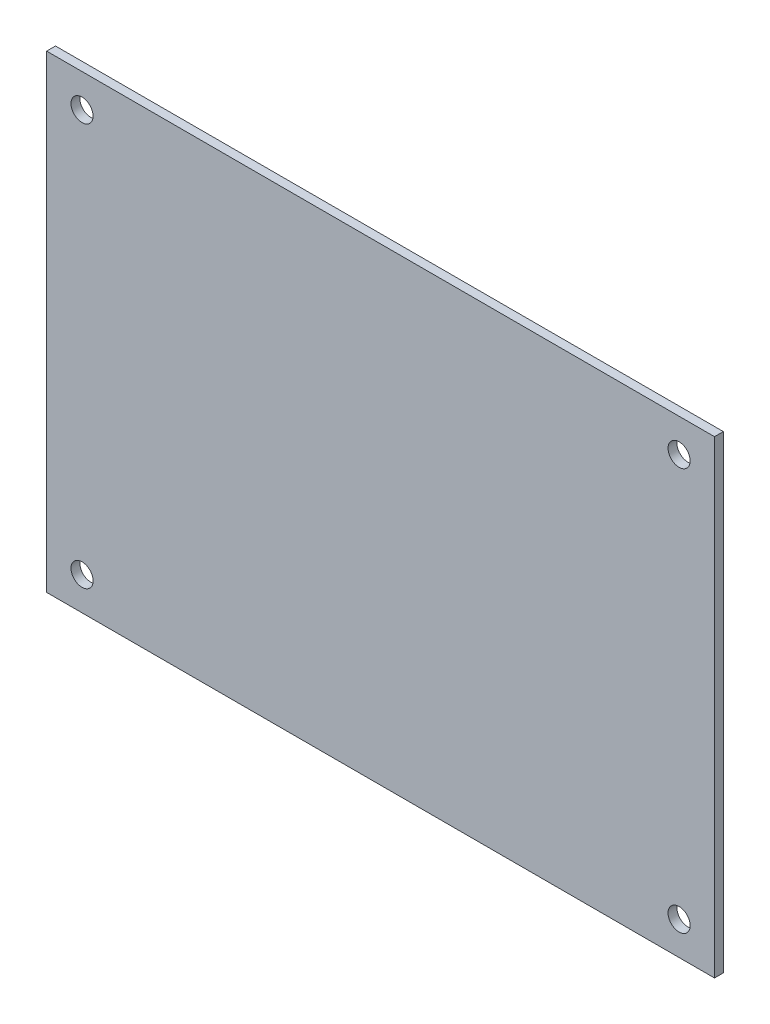
ISO-10303-21;
HEADER;
FILE_DESCRIPTION(('STEP AP214'),'2;1');
FILE_NAME('part.step','',(''),(''),'','','');
FILE_SCHEMA(('AUTOMOTIVE_DESIGN { 1 0 10303 214 1 1 1 1 }'));
ENDSEC;
DATA;
#1=APPLICATION_CONTEXT('core data for automotive mechanical design processes');
#2=APPLICATION_PROTOCOL_DEFINITION('international standard','automotive_design',2000,#1);
#3=PRODUCT_CONTEXT('',#1,'mechanical');
#4=PRODUCT('Part','Part','',(#3));
#5=PRODUCT_RELATED_PRODUCT_CATEGORY('part','',(#4));
#6=PRODUCT_DEFINITION_FORMATION('','',#4);
#7=PRODUCT_DEFINITION_CONTEXT('part definition',#1,'design');
#8=PRODUCT_DEFINITION('design','',#6,#7);
#9=PRODUCT_DEFINITION_SHAPE('','',#8);
#10=(LENGTH_UNIT() NAMED_UNIT(*) SI_UNIT(.MILLI.,.METRE.));
#11=(NAMED_UNIT(*) PLANE_ANGLE_UNIT() SI_UNIT($,.RADIAN.));
#12=(NAMED_UNIT(*) SI_UNIT($,.STERADIAN.) SOLID_ANGLE_UNIT());
#13=UNCERTAINTY_MEASURE_WITH_UNIT(LENGTH_MEASURE(1.E-05),#10,'distance_accuracy_value','');
#14=(GEOMETRIC_REPRESENTATION_CONTEXT(3) GLOBAL_UNCERTAINTY_ASSIGNED_CONTEXT((#13)) GLOBAL_UNIT_ASSIGNED_CONTEXT((#10,
#11,#12)) REPRESENTATION_CONTEXT('',''));
#15=CARTESIAN_POINT('',(0.,0.,0.));
#16=DIRECTION('',(0.,0.,1.));
#17=DIRECTION('',(1.,0.,0.));
#18=AXIS2_PLACEMENT_3D('',#15,#16,#17);
#19=CARTESIAN_POINT('',(0.,0.,0.));
#20=DIRECTION('',(0.,0.,1.));
#21=DIRECTION('',(1.,0.,0.));
#22=AXIS2_PLACEMENT_3D('',#19,#20,#21);
#23=PLANE('',#22);
#24=DIRECTION('',(0.,-1.,0.));
#25=VECTOR('',#24,1.);
#26=CARTESIAN_POINT('',(2.,0.,0.));
#27=LINE('',#26,#25);
#28=CARTESIAN_POINT('',(2.,108.,0.));
#29=VERTEX_POINT('',#28);
#30=CARTESIAN_POINT('',(2.,2.,0.));
#31=VERTEX_POINT('',#30);
#32=EDGE_CURVE('E89',#29,#31,#27,.T.);
#33=ORIENTED_EDGE('',*,*,#32,.F.);
#34=DIRECTION('',(1.,0.,0.));
#35=VECTOR('',#34,1.);
#36=CARTESIAN_POINT('',(0.,108.,0.));
#37=LINE('',#36,#35);
#38=CARTESIAN_POINT('',(153.,108.,0.));
#39=VERTEX_POINT('',#38);
#40=EDGE_CURVE('E83',#29,#39,#37,.T.);
#41=ORIENTED_EDGE('',*,*,#40,.T.);
#42=DIRECTION('',(0.,-1.,0.));
#43=VECTOR('',#42,1.);
#44=CARTESIAN_POINT('',(153.,0.,0.));
#45=LINE('',#44,#43);
#46=CARTESIAN_POINT('',(153.,2.,0.));
#47=VERTEX_POINT('',#46);
#48=EDGE_CURVE('E92',#39,#47,#45,.T.);
#49=ORIENTED_EDGE('',*,*,#48,.T.);
#50=DIRECTION('',(-1.,0.,0.));
#51=VECTOR('',#50,1.);
#52=CARTESIAN_POINT('',(0.,2.,0.));
#53=LINE('',#52,#51);
#54=EDGE_CURVE('E53',#47,#31,#53,.T.);
#55=ORIENTED_EDGE('',*,*,#54,.T.);
#56=EDGE_LOOP('',(#33,#41,#49,#55));
#57=FACE_BOUND('',#56,.T.);
#58=CARTESIAN_POINT('',(145.,100.5,0.));
#59=DIRECTION('',(0.,0.,1.));
#60=DIRECTION('',(1.,0.,0.));
#61=AXIS2_PLACEMENT_3D('',#58,#59,#60);
#62=CIRCLE('',#61,2.5);
#63=CARTESIAN_POINT('',(147.5,100.5,0.));
#64=VERTEX_POINT('',#63);
#65=EDGE_CURVE('E128',#64,#64,#62,.T.);
#66=ORIENTED_EDGE('',*,*,#65,.T.);
#67=EDGE_LOOP('',(#66));
#68=FACE_BOUND('',#67,.T.);
#69=CARTESIAN_POINT('',(10.,9.5,0.));
#70=DIRECTION('',(0.,0.,1.));
#71=DIRECTION('',(1.,0.,0.));
#72=AXIS2_PLACEMENT_3D('',#69,#70,#71);
#73=CIRCLE('',#72,2.5);
#74=CARTESIAN_POINT('',(12.5,9.5,0.));
#75=VERTEX_POINT('',#74);
#76=EDGE_CURVE('E119',#75,#75,#73,.T.);
#77=ORIENTED_EDGE('',*,*,#76,.T.);
#78=EDGE_LOOP('',(#77));
#79=FACE_BOUND('',#78,.T.);
#80=CARTESIAN_POINT('',(145.,9.5,0.));
#81=DIRECTION('',(0.,0.,1.));
#82=DIRECTION('',(1.,0.,0.));
#83=AXIS2_PLACEMENT_3D('',#80,#81,#82);
#84=CIRCLE('',#83,2.5);
#85=CARTESIAN_POINT('',(147.5,9.5,0.));
#86=VERTEX_POINT('',#85);
#87=EDGE_CURVE('E108',#86,#86,#84,.T.);
#88=ORIENTED_EDGE('',*,*,#87,.T.);
#89=EDGE_LOOP('',(#88));
#90=FACE_BOUND('',#89,.T.);
#91=CARTESIAN_POINT('',(10.,100.5,0.));
#92=DIRECTION('',(0.,0.,1.));
#93=DIRECTION('',(1.,0.,0.));
#94=AXIS2_PLACEMENT_3D('',#91,#92,#93);
#95=CIRCLE('',#94,2.5);
#96=CARTESIAN_POINT('',(12.5,100.5,0.));
#97=VERTEX_POINT('',#96);
#98=EDGE_CURVE('E139',#97,#97,#95,.T.);
#99=ORIENTED_EDGE('',*,*,#98,.T.);
#100=EDGE_LOOP('',(#99));
#101=FACE_BOUND('',#100,.T.);
#102=ADVANCED_FACE('F38',(#57,#68,#79,#90,#101),#23,.F.);
#103=CARTESIAN_POINT('',(0.,0.,2.));
#104=DIRECTION('',(0.,0.,-1.));
#105=DIRECTION('',(-1.,0.,0.));
#106=AXIS2_PLACEMENT_3D('',#103,#104,#105);
#107=PLANE('',#106);
#108=CARTESIAN_POINT('',(145.,100.5,2.));
#109=DIRECTION('',(0.,0.,1.));
#110=DIRECTION('',(1.,0.,0.));
#111=AXIS2_PLACEMENT_3D('',#108,#109,#110);
#112=CIRCLE('',#111,2.5);
#113=CARTESIAN_POINT('',(147.5,100.5,2.));
#114=VERTEX_POINT('',#113);
#115=EDGE_CURVE('E123',#114,#114,#112,.T.);
#116=ORIENTED_EDGE('',*,*,#115,.F.);
#117=EDGE_LOOP('',(#116));
#118=FACE_BOUND('',#117,.T.);
#119=CARTESIAN_POINT('',(10.,9.5,2.));
#120=DIRECTION('',(0.,0.,1.));
#121=DIRECTION('',(1.,0.,0.));
#122=AXIS2_PLACEMENT_3D('',#119,#120,#121);
#123=CIRCLE('',#122,2.5);
#124=CARTESIAN_POINT('',(12.5,9.5,2.));
#125=VERTEX_POINT('',#124);
#126=EDGE_CURVE('E132',#125,#125,#123,.T.);
#127=ORIENTED_EDGE('',*,*,#126,.F.);
#128=EDGE_LOOP('',(#127));
#129=FACE_BOUND('',#128,.T.);
#130=CARTESIAN_POINT('',(145.,9.5,2.));
#131=DIRECTION('',(0.,0.,1.));
#132=DIRECTION('',(1.,0.,0.));
#133=AXIS2_PLACEMENT_3D('',#130,#131,#132);
#134=CIRCLE('',#133,2.5);
#135=CARTESIAN_POINT('',(147.5,9.5,2.));
#136=VERTEX_POINT('',#135);
#137=EDGE_CURVE('E115',#136,#136,#134,.T.);
#138=ORIENTED_EDGE('',*,*,#137,.F.);
#139=EDGE_LOOP('',(#138));
#140=FACE_BOUND('',#139,.T.);
#141=CARTESIAN_POINT('',(10.,100.5,2.));
#142=DIRECTION('',(0.,0.,1.));
#143=DIRECTION('',(1.,0.,0.));
#144=AXIS2_PLACEMENT_3D('',#141,#142,#143);
#145=CIRCLE('',#144,2.5);
#146=CARTESIAN_POINT('',(12.5,100.5,2.));
#147=VERTEX_POINT('',#146);
#148=EDGE_CURVE('E127',#147,#147,#145,.T.);
#149=ORIENTED_EDGE('',*,*,#148,.F.);
#150=EDGE_LOOP('',(#149));
#151=FACE_BOUND('',#150,.T.);
#152=DIRECTION('',(-1.,0.,0.));
#153=VECTOR('',#152,1.);
#154=CARTESIAN_POINT('',(153.,2.,2.));
#155=LINE('',#154,#153);
#156=CARTESIAN_POINT('',(153.,2.,2.));
#157=VERTEX_POINT('',#156);
#158=CARTESIAN_POINT('',(2.,2.,2.));
#159=VERTEX_POINT('',#158);
#160=EDGE_CURVE('E46',#157,#159,#155,.T.);
#161=ORIENTED_EDGE('',*,*,#160,.F.);
#162=DIRECTION('',(0.,1.,0.));
#163=VECTOR('',#162,1.);
#164=CARTESIAN_POINT('',(153.,2.,2.));
#165=LINE('',#164,#163);
#166=CARTESIAN_POINT('',(153.,108.,2.));
#167=VERTEX_POINT('',#166);
#168=EDGE_CURVE('E11',#157,#167,#165,.T.);
#169=ORIENTED_EDGE('',*,*,#168,.T.);
#170=DIRECTION('',(-1.,0.,0.));
#171=VECTOR('',#170,1.);
#172=CARTESIAN_POINT('',(153.,108.,2.));
#173=LINE('',#172,#171);
#174=CARTESIAN_POINT('',(2.,108.,2.));
#175=VERTEX_POINT('',#174);
#176=EDGE_CURVE('E86',#167,#175,#173,.T.);
#177=ORIENTED_EDGE('',*,*,#176,.T.);
#178=DIRECTION('',(0.,1.,0.));
#179=VECTOR('',#178,1.);
#180=CARTESIAN_POINT('',(2.,2.,2.));
#181=LINE('',#180,#179);
#182=EDGE_CURVE('E148',#159,#175,#181,.T.);
#183=ORIENTED_EDGE('',*,*,#182,.F.);
#184=EDGE_LOOP('',(#161,#169,#177,#183));
#185=FACE_BOUND('',#184,.T.);
#186=ADVANCED_FACE('F157',(#118,#129,#140,#151,#185),#107,.F.);
#187=CARTESIAN_POINT('',(10.,100.5,0.));
#188=DIRECTION('',(0.,0.,1.));
#189=DIRECTION('',(1.,0.,0.));
#190=AXIS2_PLACEMENT_3D('',#187,#188,#189);
#191=CYLINDRICAL_SURFACE('',#190,2.5);
#192=ORIENTED_EDGE('',*,*,#98,.F.);
#193=EDGE_LOOP('',(#192));
#194=FACE_BOUND('',#193,.T.);
#195=ORIENTED_EDGE('',*,*,#148,.T.);
#196=EDGE_LOOP('',(#195));
#197=FACE_BOUND('',#196,.T.);
#198=ADVANCED_FACE('F159',(#194,#197),#191,.F.);
#199=CARTESIAN_POINT('',(145.,9.5,0.));
#200=DIRECTION('',(0.,0.,1.));
#201=DIRECTION('',(1.,0.,0.));
#202=AXIS2_PLACEMENT_3D('',#199,#200,#201);
#203=CYLINDRICAL_SURFACE('',#202,2.5);
#204=ORIENTED_EDGE('',*,*,#87,.F.);
#205=EDGE_LOOP('',(#204));
#206=FACE_BOUND('',#205,.T.);
#207=ORIENTED_EDGE('',*,*,#137,.T.);
#208=EDGE_LOOP('',(#207));
#209=FACE_BOUND('',#208,.T.);
#210=ADVANCED_FACE('F166',(#206,#209),#203,.F.);
#211=CARTESIAN_POINT('',(10.,9.5,0.));
#212=DIRECTION('',(0.,0.,1.));
#213=DIRECTION('',(1.,0.,0.));
#214=AXIS2_PLACEMENT_3D('',#211,#212,#213);
#215=CYLINDRICAL_SURFACE('',#214,2.5);
#216=ORIENTED_EDGE('',*,*,#76,.F.);
#217=EDGE_LOOP('',(#216));
#218=FACE_BOUND('',#217,.T.);
#219=ORIENTED_EDGE('',*,*,#126,.T.);
#220=EDGE_LOOP('',(#219));
#221=FACE_BOUND('',#220,.T.);
#222=ADVANCED_FACE('F172',(#218,#221),#215,.F.);
#223=CARTESIAN_POINT('',(145.,100.5,0.));
#224=DIRECTION('',(0.,0.,1.));
#225=DIRECTION('',(1.,0.,0.));
#226=AXIS2_PLACEMENT_3D('',#223,#224,#225);
#227=CYLINDRICAL_SURFACE('',#226,2.5);
#228=ORIENTED_EDGE('',*,*,#65,.F.);
#229=EDGE_LOOP('',(#228));
#230=FACE_BOUND('',#229,.T.);
#231=ORIENTED_EDGE('',*,*,#115,.T.);
#232=EDGE_LOOP('',(#231));
#233=FACE_BOUND('',#232,.T.);
#234=ADVANCED_FACE('F175',(#230,#233),#227,.F.);
#235=CARTESIAN_POINT('',(0.,2.,0.));
#236=DIRECTION('',(0.,1.,0.));
#237=DIRECTION('',(0.,0.,1.));
#238=AXIS2_PLACEMENT_3D('',#235,#236,#237);
#239=PLANE('',#238);
#240=DIRECTION('',(0.,0.,1.));
#241=VECTOR('',#240,1.);
#242=CARTESIAN_POINT('',(2.,2.,0.));
#243=LINE('',#242,#241);
#244=EDGE_CURVE('E109',#31,#159,#243,.T.);
#245=ORIENTED_EDGE('',*,*,#244,.F.);
#246=ORIENTED_EDGE('',*,*,#54,.F.);
#247=DIRECTION('',(0.,0.,1.));
#248=VECTOR('',#247,1.);
#249=CARTESIAN_POINT('',(153.,2.,0.));
#250=LINE('',#249,#248);
#251=EDGE_CURVE('E88',#47,#157,#250,.T.);
#252=ORIENTED_EDGE('',*,*,#251,.T.);
#253=ORIENTED_EDGE('',*,*,#160,.T.);
#254=EDGE_LOOP('',(#245,#246,#252,#253));
#255=FACE_BOUND('',#254,.T.);
#256=ADVANCED_FACE('F152',(#255),#239,.F.);
#257=CARTESIAN_POINT('',(153.,0.,0.));
#258=DIRECTION('',(-1.,0.,0.));
#259=DIRECTION('',(0.,0.,1.));
#260=AXIS2_PLACEMENT_3D('',#257,#258,#259);
#261=PLANE('',#260);
#262=ORIENTED_EDGE('',*,*,#251,.F.);
#263=ORIENTED_EDGE('',*,*,#48,.F.);
#264=DIRECTION('',(0.,0.,1.));
#265=VECTOR('',#264,1.);
#266=CARTESIAN_POINT('',(153.,108.,0.));
#267=LINE('',#266,#265);
#268=EDGE_CURVE('E61',#39,#167,#267,.T.);
#269=ORIENTED_EDGE('',*,*,#268,.T.);
#270=ORIENTED_EDGE('',*,*,#168,.F.);
#271=EDGE_LOOP('',(#262,#263,#269,#270));
#272=FACE_BOUND('',#271,.T.);
#273=ADVANCED_FACE('F93',(#272),#261,.F.);
#274=CARTESIAN_POINT('',(0.,108.,0.));
#275=DIRECTION('',(0.,-1.,0.));
#276=DIRECTION('',(0.,0.,-1.));
#277=AXIS2_PLACEMENT_3D('',#274,#275,#276);
#278=PLANE('',#277);
#279=ORIENTED_EDGE('',*,*,#268,.F.);
#280=ORIENTED_EDGE('',*,*,#40,.F.);
#281=DIRECTION('',(0.,0.,1.));
#282=VECTOR('',#281,1.);
#283=CARTESIAN_POINT('',(2.,108.,0.));
#284=LINE('',#283,#282);
#285=EDGE_CURVE('E105',#29,#175,#284,.T.);
#286=ORIENTED_EDGE('',*,*,#285,.T.);
#287=ORIENTED_EDGE('',*,*,#176,.F.);
#288=EDGE_LOOP('',(#279,#280,#286,#287));
#289=FACE_BOUND('',#288,.T.);
#290=ADVANCED_FACE('F80',(#289),#278,.F.);
#291=CARTESIAN_POINT('',(2.,0.,0.));
#292=DIRECTION('',(-1.,0.,0.));
#293=DIRECTION('',(0.,0.,1.));
#294=AXIS2_PLACEMENT_3D('',#291,#292,#293);
#295=PLANE('',#294);
#296=ORIENTED_EDGE('',*,*,#182,.T.);
#297=ORIENTED_EDGE('',*,*,#285,.F.);
#298=ORIENTED_EDGE('',*,*,#32,.T.);
#299=ORIENTED_EDGE('',*,*,#244,.T.);
#300=EDGE_LOOP('',(#296,#297,#298,#299));
#301=FACE_BOUND('',#300,.T.);
#302=ADVANCED_FACE('F156',(#301),#295,.T.);
#303=CLOSED_SHELL('',(#102,#186,#198,#210,#222,#234,#256,#273,#290,#302));
#304=MANIFOLD_SOLID_BREP('B2',#303);
#305=ADVANCED_BREP_SHAPE_REPRESENTATION('',(#18,#304),#14);
#306=SHAPE_DEFINITION_REPRESENTATION(#9,#305);
ENDSEC;
END-ISO-10303-21;
